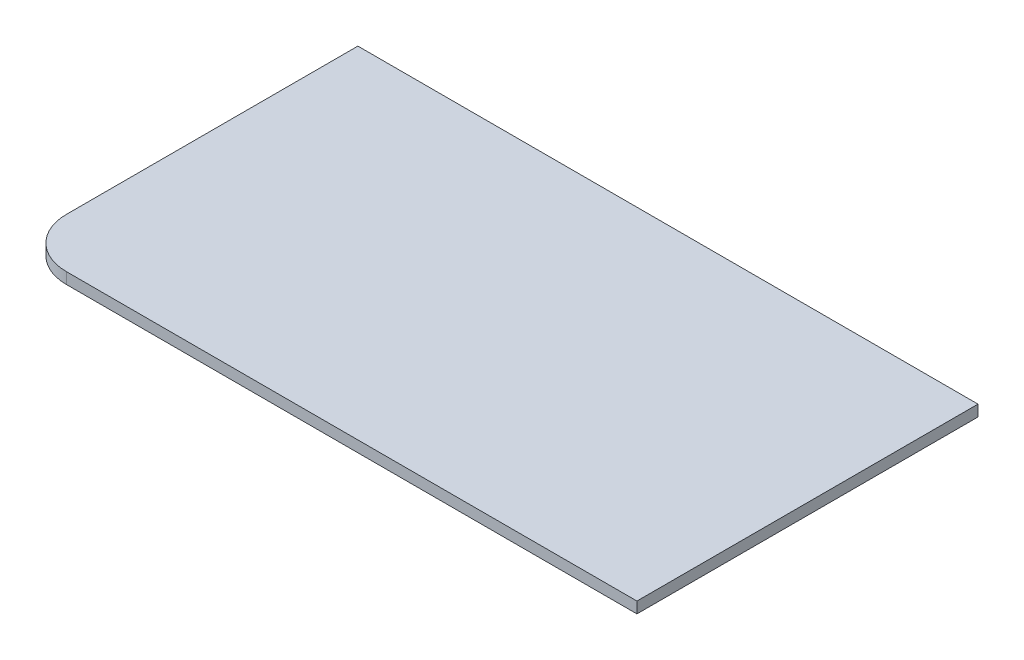
ISO-10303-21;
HEADER;
FILE_DESCRIPTION(('STEP AP214'),'2;1');
FILE_NAME('part.step','',(''),(''),'','','');
FILE_SCHEMA(('AUTOMOTIVE_DESIGN { 1 0 10303 214 1 1 1 1 }'));
ENDSEC;
DATA;
#1=APPLICATION_CONTEXT('core data for automotive mechanical design processes');
#2=APPLICATION_PROTOCOL_DEFINITION('international standard','automotive_design',2000,#1);
#3=PRODUCT_CONTEXT('',#1,'mechanical');
#4=PRODUCT('Part','Part','',(#3));
#5=PRODUCT_RELATED_PRODUCT_CATEGORY('part','',(#4));
#6=PRODUCT_DEFINITION_FORMATION('','',#4);
#7=PRODUCT_DEFINITION_CONTEXT('part definition',#1,'design');
#8=PRODUCT_DEFINITION('design','',#6,#7);
#9=PRODUCT_DEFINITION_SHAPE('','',#8);
#10=(LENGTH_UNIT() NAMED_UNIT(*) SI_UNIT(.MILLI.,.METRE.));
#11=(NAMED_UNIT(*) PLANE_ANGLE_UNIT() SI_UNIT($,.RADIAN.));
#12=(NAMED_UNIT(*) SI_UNIT($,.STERADIAN.) SOLID_ANGLE_UNIT());
#13=UNCERTAINTY_MEASURE_WITH_UNIT(LENGTH_MEASURE(1.E-05),#10,'distance_accuracy_value','');
#14=(GEOMETRIC_REPRESENTATION_CONTEXT(3) GLOBAL_UNCERTAINTY_ASSIGNED_CONTEXT((#13)) GLOBAL_UNIT_ASSIGNED_CONTEXT((#10,
#11,#12)) REPRESENTATION_CONTEXT('',''));
#15=CARTESIAN_POINT('',(0.,0.,0.));
#16=DIRECTION('',(0.,0.,1.));
#17=DIRECTION('',(1.,0.,0.));
#18=AXIS2_PLACEMENT_3D('',#15,#16,#17);
#19=CARTESIAN_POINT('',(-73.3199657590413,18.,-75.2895069061934));
#20=DIRECTION('',(1.,0.,0.));
#21=DIRECTION('',(0.,0.,-1.));
#22=AXIS2_PLACEMENT_3D('',#19,#20,#21);
#23=PLANE('',#22);
#24=DIRECTION('',(0.,0.,1.));
#25=VECTOR('',#24,1.);
#26=CARTESIAN_POINT('',(-73.3199657590413,0.,-75.2895069061934));
#27=LINE('',#26,#25);
#28=CARTESIAN_POINT('',(-73.3199657590413,0.,-75.2895069061934));
#29=VERTEX_POINT('',#28);
#30=CARTESIAN_POINT('',(-73.3199657590413,0.,394.710493093806));
#31=VERTEX_POINT('',#30);
#32=EDGE_CURVE('E104',#29,#31,#27,.T.);
#33=ORIENTED_EDGE('',*,*,#32,.T.);
#34=DIRECTION('',(0.,-1.,0.));
#35=VECTOR('',#34,1.);
#36=CARTESIAN_POINT('',(-73.3199657590413,18.,394.710493093806));
#37=LINE('',#36,#35);
#38=CARTESIAN_POINT('',(-73.3199657590413,18.,394.710493093806));
#39=VERTEX_POINT('',#38);
#40=EDGE_CURVE('E11',#39,#31,#37,.T.);
#41=ORIENTED_EDGE('',*,*,#40,.F.);
#42=DIRECTION('',(0.,0.,1.));
#43=VECTOR('',#42,1.);
#44=CARTESIAN_POINT('',(-73.3199657590413,18.,-75.2895069061934));
#45=LINE('',#44,#43);
#46=CARTESIAN_POINT('',(-73.3199657590413,18.,-75.2895069061934));
#47=VERTEX_POINT('',#46);
#48=EDGE_CURVE('E112',#47,#39,#45,.T.);
#49=ORIENTED_EDGE('',*,*,#48,.F.);
#50=DIRECTION('',(0.,-1.,0.));
#51=VECTOR('',#50,1.);
#52=CARTESIAN_POINT('',(-73.3199657590413,18.,-75.2895069061934));
#53=LINE('',#52,#51);
#54=EDGE_CURVE('E100',#47,#29,#53,.T.);
#55=ORIENTED_EDGE('',*,*,#54,.T.);
#56=EDGE_LOOP('',(#33,#41,#49,#55));
#57=FACE_BOUND('',#56,.T.);
#58=ADVANCED_FACE('F30',(#57),#23,.F.);
#59=CARTESIAN_POINT('',(6.68003424095877,18.,394.710493093807));
#60=DIRECTION('',(0.,-1.,0.));
#61=DIRECTION('',(0.,0.,-1.));
#62=AXIS2_PLACEMENT_3D('',#59,#60,#61);
#63=CYLINDRICAL_SURFACE('',#62,80.);
#64=CARTESIAN_POINT('',(6.68003424095877,0.,394.710493093807));
#65=DIRECTION('',(0.,1.,0.));
#66=DIRECTION('',(0.,0.,1.));
#67=AXIS2_PLACEMENT_3D('',#64,#65,#66);
#68=CIRCLE('',#67,80.);
#69=CARTESIAN_POINT('',(6.68003424095934,0.,474.710493093807));
#70=VERTEX_POINT('',#69);
#71=EDGE_CURVE('E107',#31,#70,#68,.T.);
#72=ORIENTED_EDGE('',*,*,#71,.T.);
#73=DIRECTION('',(0.,-1.,0.));
#74=VECTOR('',#73,1.);
#75=CARTESIAN_POINT('',(6.68003424095934,18.,474.710493093807));
#76=LINE('',#75,#74);
#77=CARTESIAN_POINT('',(6.68003424095934,18.,474.710493093807));
#78=VERTEX_POINT('',#77);
#79=EDGE_CURVE('E38',#78,#70,#76,.T.);
#80=ORIENTED_EDGE('',*,*,#79,.F.);
#81=CARTESIAN_POINT('',(6.68003424095877,18.,394.710493093807));
#82=DIRECTION('',(0.,1.,0.));
#83=DIRECTION('',(0.,0.,1.));
#84=AXIS2_PLACEMENT_3D('',#81,#82,#83);
#85=CIRCLE('',#84,80.);
#86=EDGE_CURVE('E80',#39,#78,#85,.T.);
#87=ORIENTED_EDGE('',*,*,#86,.F.);
#88=ORIENTED_EDGE('',*,*,#40,.T.);
#89=EDGE_LOOP('',(#72,#80,#87,#88));
#90=FACE_BOUND('',#89,.T.);
#91=ADVANCED_FACE('F131',(#90),#63,.T.);
#92=CARTESIAN_POINT('',(6.68003424095934,18.,474.710493093807));
#93=DIRECTION('',(0.,0.,-1.));
#94=DIRECTION('',(-1.,0.,0.));
#95=AXIS2_PLACEMENT_3D('',#92,#93,#94);
#96=PLANE('',#95);
#97=DIRECTION('',(1.,0.,0.));
#98=VECTOR('',#97,1.);
#99=CARTESIAN_POINT('',(6.68003424095934,0.,474.710493093807));
#100=LINE('',#99,#98);
#101=CARTESIAN_POINT('',(926.680034240959,0.,474.710493093807));
#102=VERTEX_POINT('',#101);
#103=EDGE_CURVE('E95',#70,#102,#100,.T.);
#104=ORIENTED_EDGE('',*,*,#103,.T.);
#105=DIRECTION('',(0.,-1.,0.));
#106=VECTOR('',#105,1.);
#107=CARTESIAN_POINT('',(926.680034240959,18.,474.710493093807));
#108=LINE('',#107,#106);
#109=CARTESIAN_POINT('',(926.680034240959,18.,474.710493093807));
#110=VERTEX_POINT('',#109);
#111=EDGE_CURVE('E92',#110,#102,#108,.T.);
#112=ORIENTED_EDGE('',*,*,#111,.F.);
#113=DIRECTION('',(1.,0.,0.));
#114=VECTOR('',#113,1.);
#115=CARTESIAN_POINT('',(6.68003424095934,18.,474.710493093807));
#116=LINE('',#115,#114);
#117=EDGE_CURVE('E84',#78,#110,#116,.T.);
#118=ORIENTED_EDGE('',*,*,#117,.F.);
#119=ORIENTED_EDGE('',*,*,#79,.T.);
#120=EDGE_LOOP('',(#104,#112,#118,#119));
#121=FACE_BOUND('',#120,.T.);
#122=ADVANCED_FACE('F93',(#121),#96,.F.);
#123=CARTESIAN_POINT('',(926.680034240959,18.,-75.2895069061934));
#124=DIRECTION('',(-1.,0.,0.));
#125=DIRECTION('',(0.,0.,1.));
#126=AXIS2_PLACEMENT_3D('',#123,#124,#125);
#127=PLANE('',#126);
#128=DIRECTION('',(0.,0.,-1.));
#129=VECTOR('',#128,1.);
#130=CARTESIAN_POINT('',(926.680034240959,0.,-75.2895069061934));
#131=LINE('',#130,#129);
#132=CARTESIAN_POINT('',(926.680034240959,0.,-75.2895069061934));
#133=VERTEX_POINT('',#132);
#134=EDGE_CURVE('E66',#102,#133,#131,.T.);
#135=ORIENTED_EDGE('',*,*,#134,.T.);
#136=DIRECTION('',(0.,-1.,0.));
#137=VECTOR('',#136,1.);
#138=CARTESIAN_POINT('',(926.680034240959,18.,-75.2895069061934));
#139=LINE('',#138,#137);
#140=CARTESIAN_POINT('',(926.680034240959,18.,-75.2895069061934));
#141=VERTEX_POINT('',#140);
#142=EDGE_CURVE('E96',#141,#133,#139,.T.);
#143=ORIENTED_EDGE('',*,*,#142,.F.);
#144=DIRECTION('',(0.,0.,-1.));
#145=VECTOR('',#144,1.);
#146=CARTESIAN_POINT('',(926.680034240959,18.,-75.2895069061934));
#147=LINE('',#146,#145);
#148=EDGE_CURVE('E88',#110,#141,#147,.T.);
#149=ORIENTED_EDGE('',*,*,#148,.F.);
#150=ORIENTED_EDGE('',*,*,#111,.T.);
#151=EDGE_LOOP('',(#135,#143,#149,#150));
#152=FACE_BOUND('',#151,.T.);
#153=ADVANCED_FACE('F98',(#152),#127,.F.);
#154=CARTESIAN_POINT('',(-73.3199657590413,18.,-75.2895069061934));
#155=DIRECTION('',(0.,0.,1.));
#156=DIRECTION('',(1.,0.,0.));
#157=AXIS2_PLACEMENT_3D('',#154,#155,#156);
#158=PLANE('',#157);
#159=DIRECTION('',(-1.,0.,0.));
#160=VECTOR('',#159,1.);
#161=CARTESIAN_POINT('',(-73.3199657590413,0.,-75.2895069061934));
#162=LINE('',#161,#160);
#163=EDGE_CURVE('E72',#133,#29,#162,.T.);
#164=ORIENTED_EDGE('',*,*,#163,.T.);
#165=ORIENTED_EDGE('',*,*,#54,.F.);
#166=DIRECTION('',(-1.,0.,0.));
#167=VECTOR('',#166,1.);
#168=CARTESIAN_POINT('',(-73.3199657590413,18.,-75.2895069061934));
#169=LINE('',#168,#167);
#170=EDGE_CURVE('E46',#141,#47,#169,.T.);
#171=ORIENTED_EDGE('',*,*,#170,.F.);
#172=ORIENTED_EDGE('',*,*,#142,.T.);
#173=EDGE_LOOP('',(#164,#165,#171,#172));
#174=FACE_BOUND('',#173,.T.);
#175=ADVANCED_FACE('F120',(#174),#158,.F.);
#176=CARTESIAN_POINT('',(6.68003424095877,18.,394.710493093807));
#177=DIRECTION('',(0.,1.,0.));
#178=DIRECTION('',(0.,0.,1.));
#179=AXIS2_PLACEMENT_3D('',#176,#177,#178);
#180=PLANE('',#179);
#181=ORIENTED_EDGE('',*,*,#48,.T.);
#182=ORIENTED_EDGE('',*,*,#86,.T.);
#183=ORIENTED_EDGE('',*,*,#117,.T.);
#184=ORIENTED_EDGE('',*,*,#148,.T.);
#185=ORIENTED_EDGE('',*,*,#170,.T.);
#186=EDGE_LOOP('',(#181,#182,#183,#184,#185));
#187=FACE_BOUND('',#186,.T.);
#188=ADVANCED_FACE('F86',(#187),#180,.T.);
#189=CARTESIAN_POINT('',(6.68003424095877,0.,394.710493093807));
#190=DIRECTION('',(0.,1.,0.));
#191=DIRECTION('',(0.,0.,1.));
#192=AXIS2_PLACEMENT_3D('',#189,#190,#191);
#193=PLANE('',#192);
#194=ORIENTED_EDGE('',*,*,#32,.F.);
#195=ORIENTED_EDGE('',*,*,#163,.F.);
#196=ORIENTED_EDGE('',*,*,#134,.F.);
#197=ORIENTED_EDGE('',*,*,#103,.F.);
#198=ORIENTED_EDGE('',*,*,#71,.F.);
#199=EDGE_LOOP('',(#194,#195,#196,#197,#198));
#200=FACE_BOUND('',#199,.T.);
#201=ADVANCED_FACE('F116',(#200),#193,.F.);
#202=CLOSED_SHELL('',(#58,#91,#122,#153,#175,#188,#201));
#203=MANIFOLD_SOLID_BREP('B2',#202);
#204=ADVANCED_BREP_SHAPE_REPRESENTATION('',(#18,#203),#14);
#205=SHAPE_DEFINITION_REPRESENTATION(#9,#204);
ENDSEC;
END-ISO-10303-21;
